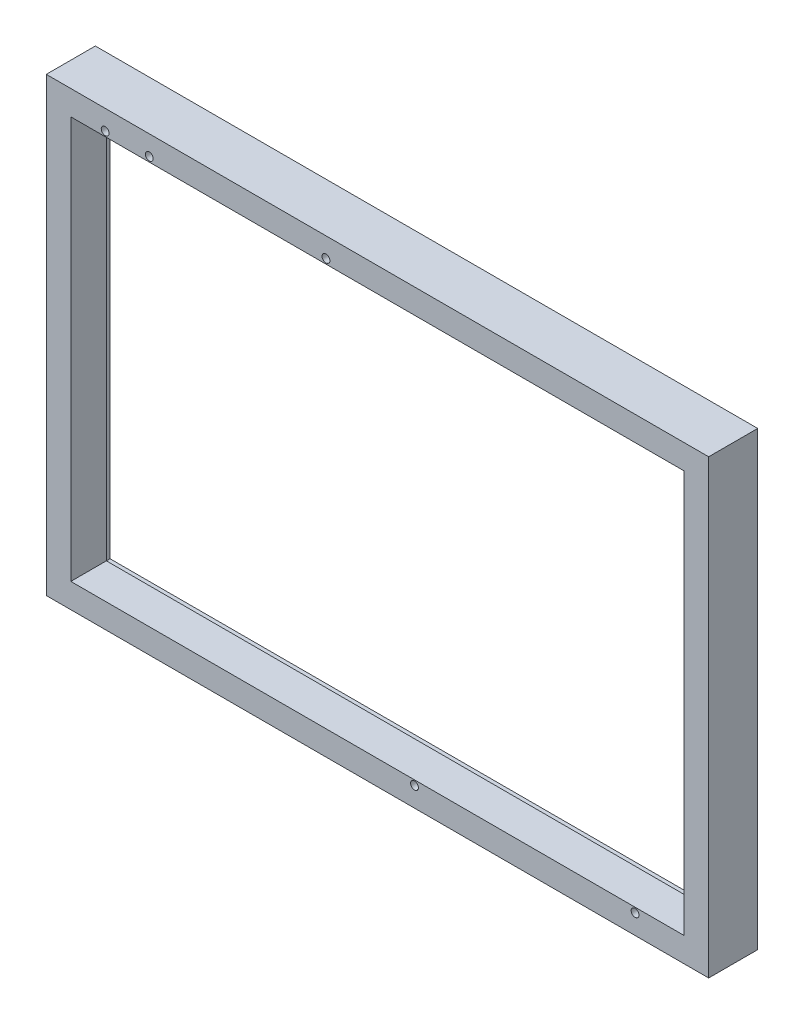
ISO-10303-21;
HEADER;
FILE_DESCRIPTION(('STEP AP214'),'2;1');
FILE_NAME('part.step','',(''),(''),'','','');
FILE_SCHEMA(('AUTOMOTIVE_DESIGN { 1 0 10303 214 1 1 1 1 }'));
ENDSEC;
DATA;
#1=APPLICATION_CONTEXT('core data for automotive mechanical design processes');
#2=APPLICATION_PROTOCOL_DEFINITION('international standard','automotive_design',2000,#1);
#3=PRODUCT_CONTEXT('',#1,'mechanical');
#4=PRODUCT('Part','Part','',(#3));
#5=PRODUCT_RELATED_PRODUCT_CATEGORY('part','',(#4));
#6=PRODUCT_DEFINITION_FORMATION('','',#4);
#7=PRODUCT_DEFINITION_CONTEXT('part definition',#1,'design');
#8=PRODUCT_DEFINITION('design','',#6,#7);
#9=PRODUCT_DEFINITION_SHAPE('','',#8);
#10=(LENGTH_UNIT() NAMED_UNIT(*) SI_UNIT(.MILLI.,.METRE.));
#11=(NAMED_UNIT(*) PLANE_ANGLE_UNIT() SI_UNIT($,.RADIAN.));
#12=(NAMED_UNIT(*) SI_UNIT($,.STERADIAN.) SOLID_ANGLE_UNIT());
#13=UNCERTAINTY_MEASURE_WITH_UNIT(LENGTH_MEASURE(1.E-05),#10,'distance_accuracy_value','');
#14=(GEOMETRIC_REPRESENTATION_CONTEXT(3) GLOBAL_UNCERTAINTY_ASSIGNED_CONTEXT((#13)) GLOBAL_UNIT_ASSIGNED_CONTEXT((#10,
#11,#12)) REPRESENTATION_CONTEXT('',''));
#15=CARTESIAN_POINT('',(0.,0.,0.));
#16=DIRECTION('',(0.,0.,1.));
#17=DIRECTION('',(1.,0.,0.));
#18=AXIS2_PLACEMENT_3D('',#15,#16,#17);
#19=CARTESIAN_POINT('',(-5.,-5.,-0.0001));
#20=DIRECTION('',(-1.,0.,0.));
#21=DIRECTION('',(0.,0.,1.));
#22=AXIS2_PLACEMENT_3D('',#19,#20,#21);
#23=PLANE('',#22);
#24=DIRECTION('',(0.,0.,1.));
#25=VECTOR('',#24,1.);
#26=CARTESIAN_POINT('',(-5.,-5.,-0.0001));
#27=LINE('',#26,#25);
#28=CARTESIAN_POINT('',(-5.,-5.,-0.0001));
#29=VERTEX_POINT('',#28);
#30=CARTESIAN_POINT('',(-5.,-5.,10.));
#31=VERTEX_POINT('',#30);
#32=EDGE_CURVE('E242',#29,#31,#27,.T.);
#33=ORIENTED_EDGE('',*,*,#32,.T.);
#34=DIRECTION('',(0.,-1.,0.));
#35=VECTOR('',#34,1.);
#36=CARTESIAN_POINT('',(-5.,-5.,10.));
#37=LINE('',#36,#35);
#38=CARTESIAN_POINT('',(-5.,87.,10.));
#39=VERTEX_POINT('',#38);
#40=EDGE_CURVE('E211',#39,#31,#37,.T.);
#41=ORIENTED_EDGE('',*,*,#40,.F.);
#42=DIRECTION('',(0.,0.,1.));
#43=VECTOR('',#42,1.);
#44=CARTESIAN_POINT('',(-5.,87.,-0.0001));
#45=LINE('',#44,#43);
#46=CARTESIAN_POINT('',(-5.,87.,-0.0001));
#47=VERTEX_POINT('',#46);
#48=EDGE_CURVE('E11',#47,#39,#45,.T.);
#49=ORIENTED_EDGE('',*,*,#48,.F.);
#50=DIRECTION('',(0.,-1.,0.));
#51=VECTOR('',#50,1.);
#52=CARTESIAN_POINT('',(-5.,-5.,-0.0001));
#53=LINE('',#52,#51);
#54=EDGE_CURVE('E226',#47,#29,#53,.T.);
#55=ORIENTED_EDGE('',*,*,#54,.T.);
#56=EDGE_LOOP('',(#33,#41,#49,#55));
#57=FACE_BOUND('',#56,.T.);
#58=ADVANCED_FACE('F35',(#57),#23,.T.);
#59=CARTESIAN_POINT('',(-5.,87.,-0.0001));
#60=DIRECTION('',(0.,1.,0.));
#61=DIRECTION('',(0.,0.,1.));
#62=AXIS2_PLACEMENT_3D('',#59,#60,#61);
#63=PLANE('',#62);
#64=ORIENTED_EDGE('',*,*,#48,.T.);
#65=DIRECTION('',(-1.,0.,0.));
#66=VECTOR('',#65,1.);
#67=CARTESIAN_POINT('',(-5.,87.,10.));
#68=LINE('',#67,#66);
#69=CARTESIAN_POINT('',(130.,87.,10.));
#70=VERTEX_POINT('',#69);
#71=EDGE_CURVE('E220',#70,#39,#68,.T.);
#72=ORIENTED_EDGE('',*,*,#71,.F.);
#73=DIRECTION('',(0.,0.,1.));
#74=VECTOR('',#73,1.);
#75=CARTESIAN_POINT('',(130.,87.,-0.0001));
#76=LINE('',#75,#74);
#77=CARTESIAN_POINT('',(130.,87.,-0.0001));
#78=VERTEX_POINT('',#77);
#79=EDGE_CURVE('E43',#78,#70,#76,.T.);
#80=ORIENTED_EDGE('',*,*,#79,.F.);
#81=DIRECTION('',(-1.,0.,0.));
#82=VECTOR('',#81,1.);
#83=CARTESIAN_POINT('',(-5.,87.,-0.0001));
#84=LINE('',#83,#82);
#85=EDGE_CURVE('E240',#78,#47,#84,.T.);
#86=ORIENTED_EDGE('',*,*,#85,.T.);
#87=EDGE_LOOP('',(#64,#72,#80,#86));
#88=FACE_BOUND('',#87,.T.);
#89=ADVANCED_FACE('F259',(#88),#63,.T.);
#90=CARTESIAN_POINT('',(130.,-5.,-0.0001));
#91=DIRECTION('',(1.,0.,0.));
#92=DIRECTION('',(0.,0.,-1.));
#93=AXIS2_PLACEMENT_3D('',#90,#91,#92);
#94=PLANE('',#93);
#95=ORIENTED_EDGE('',*,*,#79,.T.);
#96=DIRECTION('',(0.,1.,0.));
#97=VECTOR('',#96,1.);
#98=CARTESIAN_POINT('',(130.,-5.,10.));
#99=LINE('',#98,#97);
#100=CARTESIAN_POINT('',(130.,-5.,10.));
#101=VERTEX_POINT('',#100);
#102=EDGE_CURVE('E217',#101,#70,#99,.T.);
#103=ORIENTED_EDGE('',*,*,#102,.F.);
#104=DIRECTION('',(0.,0.,1.));
#105=VECTOR('',#104,1.);
#106=CARTESIAN_POINT('',(130.,-5.,-0.0001));
#107=LINE('',#106,#105);
#108=CARTESIAN_POINT('',(130.,-5.,-0.0001));
#109=VERTEX_POINT('',#108);
#110=EDGE_CURVE('E245',#109,#101,#107,.T.);
#111=ORIENTED_EDGE('',*,*,#110,.F.);
#112=DIRECTION('',(0.,1.,0.));
#113=VECTOR('',#112,1.);
#114=CARTESIAN_POINT('',(130.,-5.,-0.0001));
#115=LINE('',#114,#113);
#116=EDGE_CURVE('E237',#109,#78,#115,.T.);
#117=ORIENTED_EDGE('',*,*,#116,.T.);
#118=EDGE_LOOP('',(#95,#103,#111,#117));
#119=FACE_BOUND('',#118,.T.);
#120=ADVANCED_FACE('F265',(#119),#94,.T.);
#121=CARTESIAN_POINT('',(-5.,-5.,-0.0001));
#122=DIRECTION('',(0.,-1.,0.));
#123=DIRECTION('',(0.,0.,-1.));
#124=AXIS2_PLACEMENT_3D('',#121,#122,#123);
#125=PLANE('',#124);
#126=ORIENTED_EDGE('',*,*,#110,.T.);
#127=DIRECTION('',(1.,0.,0.));
#128=VECTOR('',#127,1.);
#129=CARTESIAN_POINT('',(-5.,-5.,10.));
#130=LINE('',#129,#128);
#131=EDGE_CURVE('E214',#31,#101,#130,.T.);
#132=ORIENTED_EDGE('',*,*,#131,.F.);
#133=ORIENTED_EDGE('',*,*,#32,.F.);
#134=DIRECTION('',(1.,0.,0.));
#135=VECTOR('',#134,1.);
#136=CARTESIAN_POINT('',(-5.,-5.,-0.0001));
#137=LINE('',#136,#135);
#138=EDGE_CURVE('E234',#29,#109,#137,.T.);
#139=ORIENTED_EDGE('',*,*,#138,.T.);
#140=EDGE_LOOP('',(#126,#132,#133,#139));
#141=FACE_BOUND('',#140,.T.);
#142=ADVANCED_FACE('F252',(#141),#125,.T.);
#143=CARTESIAN_POINT('',(0.,0.,-0.0001));
#144=DIRECTION('',(0.,0.,-1.));
#145=DIRECTION('',(-1.,0.,0.));
#146=AXIS2_PLACEMENT_3D('',#143,#144,#145);
#147=PLANE('',#146);
#148=DIRECTION('',(0.,-1.,0.));
#149=VECTOR('',#148,1.);
#150=CARTESIAN_POINT('',(127.,-2.,-0.0001));
#151=LINE('',#150,#149);
#152=CARTESIAN_POINT('',(127.,84.,-0.0001));
#153=VERTEX_POINT('',#152);
#154=CARTESIAN_POINT('',(127.,-2.,-0.0001));
#155=VERTEX_POINT('',#154);
#156=EDGE_CURVE('E51',#153,#155,#151,.T.);
#157=ORIENTED_EDGE('',*,*,#156,.F.);
#158=DIRECTION('',(1.,0.,0.));
#159=VECTOR('',#158,1.);
#160=CARTESIAN_POINT('',(127.,84.,-0.0001));
#161=LINE('',#160,#159);
#162=CARTESIAN_POINT('',(-2.,84.,-0.0001));
#163=VERTEX_POINT('',#162);
#164=EDGE_CURVE('E145',#163,#153,#161,.T.);
#165=ORIENTED_EDGE('',*,*,#164,.F.);
#166=DIRECTION('',(0.,1.,0.));
#167=VECTOR('',#166,1.);
#168=CARTESIAN_POINT('',(-2.,-2.,-0.0001));
#169=LINE('',#168,#167);
#170=CARTESIAN_POINT('',(-2.,-2.,-0.0001));
#171=VERTEX_POINT('',#170);
#172=EDGE_CURVE('E148',#171,#163,#169,.T.);
#173=ORIENTED_EDGE('',*,*,#172,.F.);
#174=DIRECTION('',(-1.,0.,0.));
#175=VECTOR('',#174,1.);
#176=CARTESIAN_POINT('',(127.,-2.,-0.0001));
#177=LINE('',#176,#175);
#178=EDGE_CURVE('E154',#155,#171,#177,.T.);
#179=ORIENTED_EDGE('',*,*,#178,.F.);
#180=EDGE_LOOP('',(#157,#165,#173,#179));
#181=FACE_BOUND('',#180,.T.);
#182=ORIENTED_EDGE('',*,*,#54,.F.);
#183=ORIENTED_EDGE('',*,*,#85,.F.);
#184=ORIENTED_EDGE('',*,*,#116,.F.);
#185=ORIENTED_EDGE('',*,*,#138,.F.);
#186=EDGE_LOOP('',(#182,#183,#184,#185));
#187=FACE_BOUND('',#186,.T.);
#188=ADVANCED_FACE('F262',(#181,#187),#147,.T.);
#189=CARTESIAN_POINT('',(0.,0.,-0.0001));
#190=DIRECTION('',(-1.,0.,0.));
#191=DIRECTION('',(0.,0.,1.));
#192=AXIS2_PLACEMENT_3D('',#189,#190,#191);
#193=PLANE('',#192);
#194=DIRECTION('',(0.,0.,1.));
#195=VECTOR('',#194,1.);
#196=CARTESIAN_POINT('',(0.,0.,-0.0001));
#197=LINE('',#196,#195);
#198=CARTESIAN_POINT('',(0.,0.,2.7499));
#199=VERTEX_POINT('',#198);
#200=CARTESIAN_POINT('',(0.,0.,10.));
#201=VERTEX_POINT('',#200);
#202=EDGE_CURVE('E223',#199,#201,#197,.T.);
#203=ORIENTED_EDGE('',*,*,#202,.F.);
#204=DIRECTION('',(0.,1.,0.));
#205=VECTOR('',#204,1.);
#206=CARTESIAN_POINT('',(0.,0.,2.7499));
#207=LINE('',#206,#205);
#208=CARTESIAN_POINT('',(0.,82.,2.7499));
#209=VERTEX_POINT('',#208);
#210=EDGE_CURVE('E59',#199,#209,#207,.T.);
#211=ORIENTED_EDGE('',*,*,#210,.T.);
#212=DIRECTION('',(0.,0.,1.));
#213=VECTOR('',#212,1.);
#214=CARTESIAN_POINT('',(0.,82.,-0.0001));
#215=LINE('',#214,#213);
#216=CARTESIAN_POINT('',(0.,82.,10.));
#217=VERTEX_POINT('',#216);
#218=EDGE_CURVE('E224',#209,#217,#215,.T.);
#219=ORIENTED_EDGE('',*,*,#218,.T.);
#220=DIRECTION('',(0.,-1.,0.));
#221=VECTOR('',#220,1.);
#222=CARTESIAN_POINT('',(0.,0.,10.));
#223=LINE('',#222,#221);
#224=EDGE_CURVE('E199',#217,#201,#223,.T.);
#225=ORIENTED_EDGE('',*,*,#224,.T.);
#226=EDGE_LOOP('',(#203,#211,#219,#225));
#227=FACE_BOUND('',#226,.T.);
#228=ADVANCED_FACE('F312',(#227),#193,.F.);
#229=CARTESIAN_POINT('',(0.,82.,-0.0001));
#230=DIRECTION('',(0.,1.,0.));
#231=DIRECTION('',(0.,0.,1.));
#232=AXIS2_PLACEMENT_3D('',#229,#230,#231);
#233=PLANE('',#232);
#234=ORIENTED_EDGE('',*,*,#218,.F.);
#235=DIRECTION('',(1.,0.,0.));
#236=VECTOR('',#235,1.);
#237=CARTESIAN_POINT('',(0.,82.,2.7499));
#238=LINE('',#237,#236);
#239=CARTESIAN_POINT('',(125.,82.,2.7499));
#240=VERTEX_POINT('',#239);
#241=EDGE_CURVE('E180',#209,#240,#238,.T.);
#242=ORIENTED_EDGE('',*,*,#241,.T.);
#243=DIRECTION('',(0.,0.,1.));
#244=VECTOR('',#243,1.);
#245=CARTESIAN_POINT('',(125.,82.,-0.0001));
#246=LINE('',#245,#244);
#247=CARTESIAN_POINT('',(125.,82.,10.));
#248=VERTEX_POINT('',#247);
#249=EDGE_CURVE('E227',#240,#248,#246,.T.);
#250=ORIENTED_EDGE('',*,*,#249,.T.);
#251=DIRECTION('',(-1.,0.,0.));
#252=VECTOR('',#251,1.);
#253=CARTESIAN_POINT('',(0.,82.,10.));
#254=LINE('',#253,#252);
#255=EDGE_CURVE('E208',#248,#217,#254,.T.);
#256=ORIENTED_EDGE('',*,*,#255,.T.);
#257=EDGE_LOOP('',(#234,#242,#250,#256));
#258=FACE_BOUND('',#257,.T.);
#259=ADVANCED_FACE('F322',(#258),#233,.F.);
#260=CARTESIAN_POINT('',(125.,0.,-0.0001));
#261=DIRECTION('',(1.,0.,0.));
#262=DIRECTION('',(0.,0.,-1.));
#263=AXIS2_PLACEMENT_3D('',#260,#261,#262);
#264=PLANE('',#263);
#265=ORIENTED_EDGE('',*,*,#249,.F.);
#266=DIRECTION('',(0.,-1.,0.));
#267=VECTOR('',#266,1.);
#268=CARTESIAN_POINT('',(125.,0.,2.7499));
#269=LINE('',#268,#267);
#270=CARTESIAN_POINT('',(125.,0.,2.7499));
#271=VERTEX_POINT('',#270);
#272=EDGE_CURVE('E177',#240,#271,#269,.T.);
#273=ORIENTED_EDGE('',*,*,#272,.T.);
#274=DIRECTION('',(0.,0.,1.));
#275=VECTOR('',#274,1.);
#276=CARTESIAN_POINT('',(125.,0.,-0.0001));
#277=LINE('',#276,#275);
#278=CARTESIAN_POINT('',(125.,0.,10.));
#279=VERTEX_POINT('',#278);
#280=EDGE_CURVE('E229',#271,#279,#277,.T.);
#281=ORIENTED_EDGE('',*,*,#280,.T.);
#282=DIRECTION('',(0.,1.,0.));
#283=VECTOR('',#282,1.);
#284=CARTESIAN_POINT('',(125.,0.,10.));
#285=LINE('',#284,#283);
#286=EDGE_CURVE('E205',#279,#248,#285,.T.);
#287=ORIENTED_EDGE('',*,*,#286,.T.);
#288=EDGE_LOOP('',(#265,#273,#281,#287));
#289=FACE_BOUND('',#288,.T.);
#290=ADVANCED_FACE('F332',(#289),#264,.F.);
#291=CARTESIAN_POINT('',(0.,0.,-0.0001));
#292=DIRECTION('',(0.,-1.,0.));
#293=DIRECTION('',(0.,0.,-1.));
#294=AXIS2_PLACEMENT_3D('',#291,#292,#293);
#295=PLANE('',#294);
#296=ORIENTED_EDGE('',*,*,#280,.F.);
#297=DIRECTION('',(-1.,0.,0.));
#298=VECTOR('',#297,1.);
#299=CARTESIAN_POINT('',(0.,0.,2.7499));
#300=LINE('',#299,#298);
#301=EDGE_CURVE('E175',#271,#199,#300,.T.);
#302=ORIENTED_EDGE('',*,*,#301,.T.);
#303=ORIENTED_EDGE('',*,*,#202,.T.);
#304=DIRECTION('',(1.,0.,0.));
#305=VECTOR('',#304,1.);
#306=CARTESIAN_POINT('',(0.,0.,10.));
#307=LINE('',#306,#305);
#308=EDGE_CURVE('E202',#201,#279,#307,.T.);
#309=ORIENTED_EDGE('',*,*,#308,.T.);
#310=EDGE_LOOP('',(#296,#302,#303,#309));
#311=FACE_BOUND('',#310,.T.);
#312=ADVANCED_FACE('F342',(#311),#295,.F.);
#313=CARTESIAN_POINT('',(7.,83.,-0.0001));
#314=DIRECTION('',(0.,0.,1.));
#315=DIRECTION('',(1.,0.,0.));
#316=AXIS2_PLACEMENT_3D('',#313,#314,#315);
#317=CYLINDRICAL_SURFACE('',#316,0.799999999999995);
#318=CARTESIAN_POINT('',(7.,83.,2.7499));
#319=DIRECTION('',(0.,0.,1.));
#320=DIRECTION('',(1.,0.,0.));
#321=AXIS2_PLACEMENT_3D('',#318,#319,#320);
#322=CIRCLE('',#321,0.799999999999995);
#323=CARTESIAN_POINT('',(7.8,83.,2.7499));
#324=VERTEX_POINT('',#323);
#325=EDGE_CURVE('E172',#324,#324,#322,.F.);
#326=ORIENTED_EDGE('',*,*,#325,.T.);
#327=EDGE_LOOP('',(#326));
#328=FACE_BOUND('',#327,.T.);
#329=CARTESIAN_POINT('',(7.,83.,10.));
#330=DIRECTION('',(0.,0.,1.));
#331=DIRECTION('',(1.,0.,0.));
#332=AXIS2_PLACEMENT_3D('',#329,#330,#331);
#333=CIRCLE('',#332,0.799999999999995);
#334=CARTESIAN_POINT('',(7.8,83.,10.));
#335=VERTEX_POINT('',#334);
#336=EDGE_CURVE('E196',#335,#335,#333,.T.);
#337=ORIENTED_EDGE('',*,*,#336,.T.);
#338=EDGE_LOOP('',(#337));
#339=FACE_BOUND('',#338,.T.);
#340=ADVANCED_FACE('F352',(#328,#339),#317,.F.);
#341=CARTESIAN_POINT('',(115.,-1.,-0.0001));
#342=DIRECTION('',(0.,0.,1.));
#343=DIRECTION('',(1.,0.,0.));
#344=AXIS2_PLACEMENT_3D('',#341,#342,#343);
#345=CYLINDRICAL_SURFACE('',#344,0.799999999999995);
#346=CARTESIAN_POINT('',(115.,-1.,2.7499));
#347=DIRECTION('',(0.,0.,1.));
#348=DIRECTION('',(1.,0.,0.));
#349=AXIS2_PLACEMENT_3D('',#346,#347,#348);
#350=CIRCLE('',#349,0.799999999999995);
#351=CARTESIAN_POINT('',(115.8,-1.,2.7499));
#352=VERTEX_POINT('',#351);
#353=EDGE_CURVE('E169',#352,#352,#350,.F.);
#354=ORIENTED_EDGE('',*,*,#353,.T.);
#355=EDGE_LOOP('',(#354));
#356=FACE_BOUND('',#355,.T.);
#357=CARTESIAN_POINT('',(115.,-1.,10.));
#358=DIRECTION('',(0.,0.,1.));
#359=DIRECTION('',(1.,0.,0.));
#360=AXIS2_PLACEMENT_3D('',#357,#358,#359);
#361=CIRCLE('',#360,0.799999999999995);
#362=CARTESIAN_POINT('',(115.8,-1.,10.));
#363=VERTEX_POINT('',#362);
#364=EDGE_CURVE('E193',#363,#363,#361,.T.);
#365=ORIENTED_EDGE('',*,*,#364,.T.);
#366=EDGE_LOOP('',(#365));
#367=FACE_BOUND('',#366,.T.);
#368=ADVANCED_FACE('F362',(#356,#367),#345,.F.);
#369=CARTESIAN_POINT('',(52.,83.,-0.0001));
#370=DIRECTION('',(0.,0.,1.));
#371=DIRECTION('',(1.,0.,0.));
#372=AXIS2_PLACEMENT_3D('',#369,#370,#371);
#373=CYLINDRICAL_SURFACE('',#372,0.800000000000001);
#374=CARTESIAN_POINT('',(52.,83.,2.7499));
#375=DIRECTION('',(0.,0.,1.));
#376=DIRECTION('',(1.,0.,0.));
#377=AXIS2_PLACEMENT_3D('',#374,#375,#376);
#378=CIRCLE('',#377,0.800000000000001);
#379=CARTESIAN_POINT('',(52.8,83.,2.7499));
#380=VERTEX_POINT('',#379);
#381=EDGE_CURVE('E166',#380,#380,#378,.F.);
#382=ORIENTED_EDGE('',*,*,#381,.T.);
#383=EDGE_LOOP('',(#382));
#384=FACE_BOUND('',#383,.T.);
#385=CARTESIAN_POINT('',(52.,83.,10.));
#386=DIRECTION('',(0.,0.,1.));
#387=DIRECTION('',(1.,0.,0.));
#388=AXIS2_PLACEMENT_3D('',#385,#386,#387);
#389=CIRCLE('',#388,0.800000000000001);
#390=CARTESIAN_POINT('',(52.8,83.,10.));
#391=VERTEX_POINT('',#390);
#392=EDGE_CURVE('E190',#391,#391,#389,.T.);
#393=ORIENTED_EDGE('',*,*,#392,.T.);
#394=EDGE_LOOP('',(#393));
#395=FACE_BOUND('',#394,.T.);
#396=ADVANCED_FACE('F372',(#384,#395),#373,.F.);
#397=CARTESIAN_POINT('',(70.05,-1.,-0.0001));
#398=DIRECTION('',(0.,0.,1.));
#399=DIRECTION('',(1.,0.,0.));
#400=AXIS2_PLACEMENT_3D('',#397,#398,#399);
#401=CYLINDRICAL_SURFACE('',#400,0.799999999999995);
#402=CARTESIAN_POINT('',(70.05,-1.,2.7499));
#403=DIRECTION('',(0.,0.,1.));
#404=DIRECTION('',(1.,0.,0.));
#405=AXIS2_PLACEMENT_3D('',#402,#403,#404);
#406=CIRCLE('',#405,0.799999999999995);
#407=CARTESIAN_POINT('',(70.85,-1.,2.7499));
#408=VERTEX_POINT('',#407);
#409=EDGE_CURVE('E163',#408,#408,#406,.F.);
#410=ORIENTED_EDGE('',*,*,#409,.T.);
#411=EDGE_LOOP('',(#410));
#412=FACE_BOUND('',#411,.T.);
#413=CARTESIAN_POINT('',(70.05,-1.,10.));
#414=DIRECTION('',(0.,0.,1.));
#415=DIRECTION('',(1.,0.,0.));
#416=AXIS2_PLACEMENT_3D('',#413,#414,#415);
#417=CIRCLE('',#416,0.799999999999995);
#418=CARTESIAN_POINT('',(70.85,-1.,10.));
#419=VERTEX_POINT('',#418);
#420=EDGE_CURVE('E187',#419,#419,#417,.T.);
#421=ORIENTED_EDGE('',*,*,#420,.T.);
#422=EDGE_LOOP('',(#421));
#423=FACE_BOUND('',#422,.T.);
#424=ADVANCED_FACE('F382',(#412,#423),#401,.F.);
#425=CARTESIAN_POINT('',(16.,83.,-0.0001));
#426=DIRECTION('',(0.,0.,1.));
#427=DIRECTION('',(1.,0.,0.));
#428=AXIS2_PLACEMENT_3D('',#425,#426,#427);
#429=CYLINDRICAL_SURFACE('',#428,0.799999999999998);
#430=CARTESIAN_POINT('',(16.,83.,2.7499));
#431=DIRECTION('',(0.,0.,1.));
#432=DIRECTION('',(1.,0.,0.));
#433=AXIS2_PLACEMENT_3D('',#430,#431,#432);
#434=CIRCLE('',#433,0.799999999999998);
#435=CARTESIAN_POINT('',(16.8,83.,2.7499));
#436=VERTEX_POINT('',#435);
#437=EDGE_CURVE('E38',#436,#436,#434,.F.);
#438=ORIENTED_EDGE('',*,*,#437,.T.);
#439=EDGE_LOOP('',(#438));
#440=FACE_BOUND('',#439,.T.);
#441=CARTESIAN_POINT('',(16.,83.,10.));
#442=DIRECTION('',(0.,0.,1.));
#443=DIRECTION('',(1.,0.,0.));
#444=AXIS2_PLACEMENT_3D('',#441,#442,#443);
#445=CIRCLE('',#444,0.799999999999998);
#446=CARTESIAN_POINT('',(16.8,83.,10.));
#447=VERTEX_POINT('',#446);
#448=EDGE_CURVE('E184',#447,#447,#445,.T.);
#449=ORIENTED_EDGE('',*,*,#448,.T.);
#450=EDGE_LOOP('',(#449));
#451=FACE_BOUND('',#450,.T.);
#452=ADVANCED_FACE('F301',(#440,#451),#429,.F.);
#453=CARTESIAN_POINT('',(0.,0.,10.));
#454=DIRECTION('',(0.,0.,-1.));
#455=DIRECTION('',(-1.,0.,0.));
#456=AXIS2_PLACEMENT_3D('',#453,#454,#455);
#457=PLANE('',#456);
#458=ORIENTED_EDGE('',*,*,#40,.T.);
#459=ORIENTED_EDGE('',*,*,#131,.T.);
#460=ORIENTED_EDGE('',*,*,#102,.T.);
#461=ORIENTED_EDGE('',*,*,#71,.T.);
#462=EDGE_LOOP('',(#458,#459,#460,#461));
#463=FACE_BOUND('',#462,.T.);
#464=ORIENTED_EDGE('',*,*,#224,.F.);
#465=ORIENTED_EDGE('',*,*,#255,.F.);
#466=ORIENTED_EDGE('',*,*,#286,.F.);
#467=ORIENTED_EDGE('',*,*,#308,.F.);
#468=EDGE_LOOP('',(#464,#465,#466,#467));
#469=FACE_BOUND('',#468,.T.);
#470=ORIENTED_EDGE('',*,*,#336,.F.);
#471=EDGE_LOOP('',(#470));
#472=FACE_BOUND('',#471,.T.);
#473=ORIENTED_EDGE('',*,*,#364,.F.);
#474=EDGE_LOOP('',(#473));
#475=FACE_BOUND('',#474,.T.);
#476=ORIENTED_EDGE('',*,*,#392,.F.);
#477=EDGE_LOOP('',(#476));
#478=FACE_BOUND('',#477,.T.);
#479=ORIENTED_EDGE('',*,*,#420,.F.);
#480=EDGE_LOOP('',(#479));
#481=FACE_BOUND('',#480,.T.);
#482=ORIENTED_EDGE('',*,*,#448,.F.);
#483=EDGE_LOOP('',(#482));
#484=FACE_BOUND('',#483,.T.);
#485=ADVANCED_FACE('F255',(#463,#469,#472,#475,#478,#481,#484),#457,.F.);
#486=CARTESIAN_POINT('',(0.,0.,2.7499));
#487=DIRECTION('',(0.,0.,1.));
#488=DIRECTION('',(1.,0.,0.));
#489=AXIS2_PLACEMENT_3D('',#486,#487,#488);
#490=PLANE('',#489);
#491=ORIENTED_EDGE('',*,*,#353,.F.);
#492=EDGE_LOOP('',(#491));
#493=FACE_BOUND('',#492,.T.);
#494=ORIENTED_EDGE('',*,*,#409,.F.);
#495=EDGE_LOOP('',(#494));
#496=FACE_BOUND('',#495,.T.);
#497=DIRECTION('',(0.,-1.,0.));
#498=VECTOR('',#497,1.);
#499=CARTESIAN_POINT('',(127.,-2.,2.7499));
#500=LINE('',#499,#498);
#501=CARTESIAN_POINT('',(127.,84.,2.7499));
#502=VERTEX_POINT('',#501);
#503=CARTESIAN_POINT('',(127.,-2.,2.7499));
#504=VERTEX_POINT('',#503);
#505=EDGE_CURVE('E126',#502,#504,#500,.T.);
#506=ORIENTED_EDGE('',*,*,#505,.T.);
#507=DIRECTION('',(-1.,0.,0.));
#508=VECTOR('',#507,1.);
#509=CARTESIAN_POINT('',(127.,-2.,2.7499));
#510=LINE('',#509,#508);
#511=CARTESIAN_POINT('',(-2.,-2.,2.7499));
#512=VERTEX_POINT('',#511);
#513=EDGE_CURVE('E135',#504,#512,#510,.T.);
#514=ORIENTED_EDGE('',*,*,#513,.T.);
#515=DIRECTION('',(0.,1.,0.));
#516=VECTOR('',#515,1.);
#517=CARTESIAN_POINT('',(-2.,-2.,2.7499));
#518=LINE('',#517,#516);
#519=CARTESIAN_POINT('',(-2.,84.,2.7499));
#520=VERTEX_POINT('',#519);
#521=EDGE_CURVE('E140',#512,#520,#518,.T.);
#522=ORIENTED_EDGE('',*,*,#521,.T.);
#523=DIRECTION('',(1.,0.,0.));
#524=VECTOR('',#523,1.);
#525=CARTESIAN_POINT('',(127.,84.,2.7499));
#526=LINE('',#525,#524);
#527=EDGE_CURVE('E132',#520,#502,#526,.T.);
#528=ORIENTED_EDGE('',*,*,#527,.T.);
#529=EDGE_LOOP('',(#506,#514,#522,#528));
#530=FACE_BOUND('',#529,.T.);
#531=ORIENTED_EDGE('',*,*,#437,.F.);
#532=EDGE_LOOP('',(#531));
#533=FACE_BOUND('',#532,.T.);
#534=ORIENTED_EDGE('',*,*,#381,.F.);
#535=EDGE_LOOP('',(#534));
#536=FACE_BOUND('',#535,.T.);
#537=ORIENTED_EDGE('',*,*,#325,.F.);
#538=EDGE_LOOP('',(#537));
#539=FACE_BOUND('',#538,.T.);
#540=ORIENTED_EDGE('',*,*,#301,.F.);
#541=ORIENTED_EDGE('',*,*,#272,.F.);
#542=ORIENTED_EDGE('',*,*,#241,.F.);
#543=ORIENTED_EDGE('',*,*,#210,.F.);
#544=EDGE_LOOP('',(#540,#541,#542,#543));
#545=FACE_BOUND('',#544,.T.);
#546=ADVANCED_FACE('F142',(#493,#496,#530,#533,#536,#539,#545),#490,.F.);
#547=CARTESIAN_POINT('',(127.,-2.,2.7499));
#548=DIRECTION('',(1.,0.,0.));
#549=DIRECTION('',(0.,0.,-1.));
#550=AXIS2_PLACEMENT_3D('',#547,#548,#549);
#551=PLANE('',#550);
#552=ORIENTED_EDGE('',*,*,#156,.T.);
#553=DIRECTION('',(0.,0.,-1.));
#554=VECTOR('',#553,1.);
#555=CARTESIAN_POINT('',(127.,-2.,2.7499));
#556=LINE('',#555,#554);
#557=EDGE_CURVE('E122',#504,#155,#556,.T.);
#558=ORIENTED_EDGE('',*,*,#557,.F.);
#559=ORIENTED_EDGE('',*,*,#505,.F.);
#560=DIRECTION('',(0.,0.,-1.));
#561=VECTOR('',#560,1.);
#562=CARTESIAN_POINT('',(127.,84.,2.7499));
#563=LINE('',#562,#561);
#564=EDGE_CURVE('E158',#502,#153,#563,.T.);
#565=ORIENTED_EDGE('',*,*,#564,.T.);
#566=EDGE_LOOP('',(#552,#558,#559,#565));
#567=FACE_BOUND('',#566,.T.);
#568=ADVANCED_FACE('F124',(#567),#551,.F.);
#569=CARTESIAN_POINT('',(127.,84.,2.7499));
#570=DIRECTION('',(0.,1.,0.));
#571=DIRECTION('',(0.,0.,1.));
#572=AXIS2_PLACEMENT_3D('',#569,#570,#571);
#573=PLANE('',#572);
#574=ORIENTED_EDGE('',*,*,#164,.T.);
#575=ORIENTED_EDGE('',*,*,#564,.F.);
#576=ORIENTED_EDGE('',*,*,#527,.F.);
#577=DIRECTION('',(0.,0.,-1.));
#578=VECTOR('',#577,1.);
#579=CARTESIAN_POINT('',(-2.,84.,2.7499));
#580=LINE('',#579,#578);
#581=EDGE_CURVE('E160',#520,#163,#580,.T.);
#582=ORIENTED_EDGE('',*,*,#581,.T.);
#583=EDGE_LOOP('',(#574,#575,#576,#582));
#584=FACE_BOUND('',#583,.T.);
#585=ADVANCED_FACE('F415',(#584),#573,.F.);
#586=CARTESIAN_POINT('',(-2.,-2.,2.7499));
#587=DIRECTION('',(-1.,0.,0.));
#588=DIRECTION('',(0.,-1.,0.));
#589=AXIS2_PLACEMENT_3D('',#586,#587,#588);
#590=PLANE('',#589);
#591=ORIENTED_EDGE('',*,*,#172,.T.);
#592=ORIENTED_EDGE('',*,*,#581,.F.);
#593=ORIENTED_EDGE('',*,*,#521,.F.);
#594=DIRECTION('',(0.,0.,-1.));
#595=VECTOR('',#594,1.);
#596=CARTESIAN_POINT('',(-2.,-2.,2.7499));
#597=LINE('',#596,#595);
#598=EDGE_CURVE('E131',#512,#171,#597,.T.);
#599=ORIENTED_EDGE('',*,*,#598,.T.);
#600=EDGE_LOOP('',(#591,#592,#593,#599));
#601=FACE_BOUND('',#600,.T.);
#602=ADVANCED_FACE('F424',(#601),#590,.F.);
#603=CARTESIAN_POINT('',(127.,-2.,2.7499));
#604=DIRECTION('',(0.,-1.,0.));
#605=DIRECTION('',(0.,0.,-1.));
#606=AXIS2_PLACEMENT_3D('',#603,#604,#605);
#607=PLANE('',#606);
#608=ORIENTED_EDGE('',*,*,#178,.T.);
#609=ORIENTED_EDGE('',*,*,#598,.F.);
#610=ORIENTED_EDGE('',*,*,#513,.F.);
#611=ORIENTED_EDGE('',*,*,#557,.T.);
#612=EDGE_LOOP('',(#608,#609,#610,#611));
#613=FACE_BOUND('',#612,.T.);
#614=ADVANCED_FACE('F136',(#613),#607,.F.);
#615=CLOSED_SHELL('',(#58,#89,#120,#142,#188,#228,#259,#290,#312,#340,#368,#396,#424,#452,#485,
#546,#568,#585,#602,#614));
#616=MANIFOLD_SOLID_BREP('B2',#615);
#617=ADVANCED_BREP_SHAPE_REPRESENTATION('',(#18,#616),#14);
#618=SHAPE_DEFINITION_REPRESENTATION(#9,#617);
ENDSEC;
END-ISO-10303-21;
